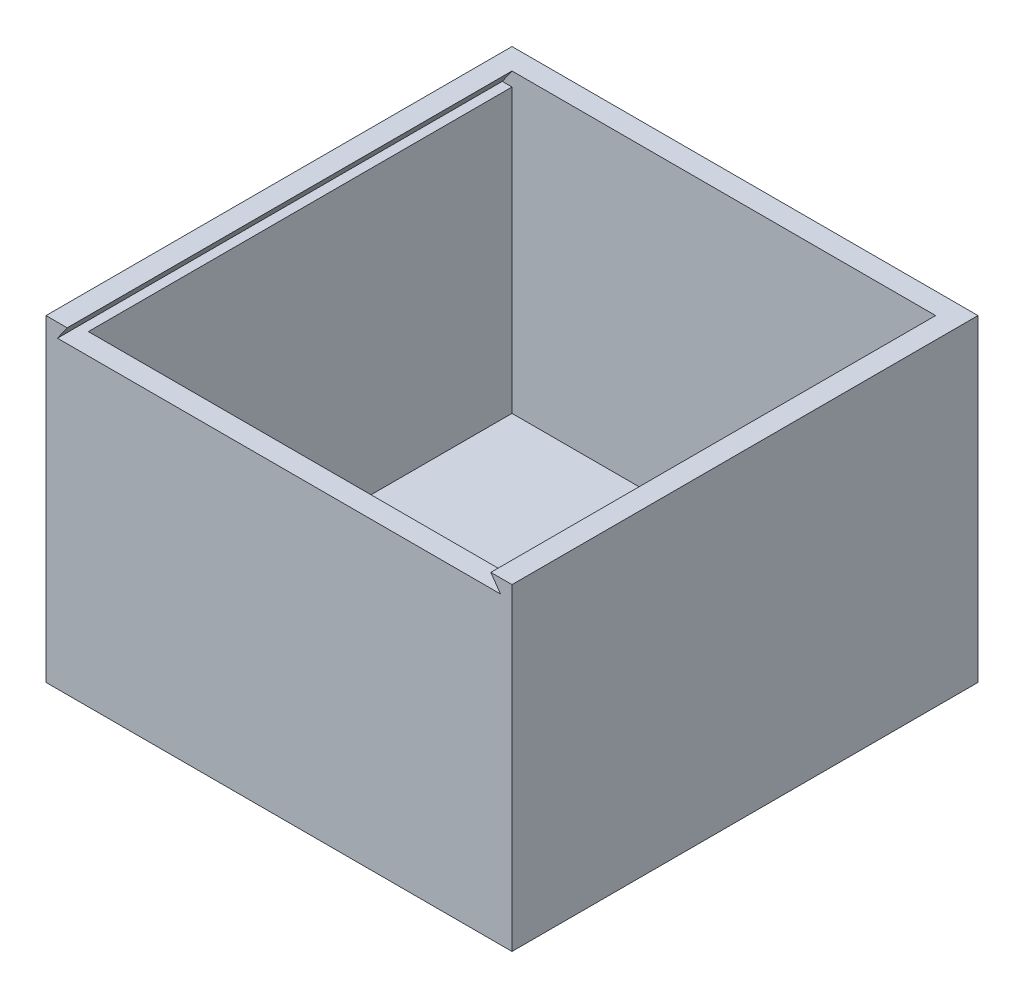
ISO-10303-21;
HEADER;
FILE_DESCRIPTION(('STEP AP214'),'2;1');
FILE_NAME('part.step','',(''),(''),'','','');
FILE_SCHEMA(('AUTOMOTIVE_DESIGN { 1 0 10303 214 1 1 1 1 }'));
ENDSEC;
DATA;
#1=APPLICATION_CONTEXT('core data for automotive mechanical design processes');
#2=APPLICATION_PROTOCOL_DEFINITION('international standard','automotive_design',2000,#1);
#3=PRODUCT_CONTEXT('',#1,'mechanical');
#4=PRODUCT('Part','Part','',(#3));
#5=PRODUCT_RELATED_PRODUCT_CATEGORY('part','',(#4));
#6=PRODUCT_DEFINITION_FORMATION('','',#4);
#7=PRODUCT_DEFINITION_CONTEXT('part definition',#1,'design');
#8=PRODUCT_DEFINITION('design','',#6,#7);
#9=PRODUCT_DEFINITION_SHAPE('','',#8);
#10=(LENGTH_UNIT() NAMED_UNIT(*) SI_UNIT(.MILLI.,.METRE.));
#11=(NAMED_UNIT(*) PLANE_ANGLE_UNIT() SI_UNIT($,.RADIAN.));
#12=(NAMED_UNIT(*) SI_UNIT($,.STERADIAN.) SOLID_ANGLE_UNIT());
#13=UNCERTAINTY_MEASURE_WITH_UNIT(LENGTH_MEASURE(1.E-05),#10,'distance_accuracy_value','');
#14=(GEOMETRIC_REPRESENTATION_CONTEXT(3) GLOBAL_UNCERTAINTY_ASSIGNED_CONTEXT((#13)) GLOBAL_UNIT_ASSIGNED_CONTEXT((#10,
#11,#12)) REPRESENTATION_CONTEXT('',''));
#15=CARTESIAN_POINT('',(0.,0.,0.));
#16=DIRECTION('',(0.,0.,1.));
#17=DIRECTION('',(1.,0.,0.));
#18=AXIS2_PLACEMENT_3D('',#15,#16,#17);
#19=CARTESIAN_POINT('',(-55.,75.,55.));
#20=DIRECTION('',(1.,0.,0.));
#21=DIRECTION('',(0.,0.,-1.));
#22=AXIS2_PLACEMENT_3D('',#19,#20,#21);
#23=PLANE('',#22);
#24=DIRECTION('',(0.,0.,1.));
#25=VECTOR('',#24,1.);
#26=CARTESIAN_POINT('',(-55.,0.,55.));
#27=LINE('',#26,#25);
#28=CARTESIAN_POINT('',(-55.,0.,-55.));
#29=VERTEX_POINT('',#28);
#30=CARTESIAN_POINT('',(-55.,0.,55.));
#31=VERTEX_POINT('',#30);
#32=EDGE_CURVE('E165',#29,#31,#27,.T.);
#33=ORIENTED_EDGE('',*,*,#32,.T.);
#34=DIRECTION('',(0.,-1.,0.));
#35=VECTOR('',#34,1.);
#36=CARTESIAN_POINT('',(-55.,75.,55.));
#37=LINE('',#36,#35);
#38=CARTESIAN_POINT('',(-55.,75.,55.));
#39=VERTEX_POINT('',#38);
#40=EDGE_CURVE('E39',#39,#31,#37,.T.);
#41=ORIENTED_EDGE('',*,*,#40,.F.);
#42=DIRECTION('',(0.,0.,1.));
#43=VECTOR('',#42,1.);
#44=CARTESIAN_POINT('',(-55.,75.,55.));
#45=LINE('',#44,#43);
#46=CARTESIAN_POINT('',(-55.,75.,-55.));
#47=VERTEX_POINT('',#46);
#48=EDGE_CURVE('E174',#47,#39,#45,.T.);
#49=ORIENTED_EDGE('',*,*,#48,.F.);
#50=DIRECTION('',(0.,-1.,0.));
#51=VECTOR('',#50,1.);
#52=CARTESIAN_POINT('',(-55.,75.,-55.));
#53=LINE('',#52,#51);
#54=EDGE_CURVE('E181',#47,#29,#53,.T.);
#55=ORIENTED_EDGE('',*,*,#54,.T.);
#56=EDGE_LOOP('',(#33,#41,#49,#55));
#57=FACE_BOUND('',#56,.T.);
#58=ADVANCED_FACE('F32',(#57),#23,.F.);
#59=CARTESIAN_POINT('',(-55.,75.,55.));
#60=DIRECTION('',(0.,0.,-1.));
#61=DIRECTION('',(-1.,0.,0.));
#62=AXIS2_PLACEMENT_3D('',#59,#60,#61);
#63=PLANE('',#62);
#64=DIRECTION('',(1.,0.,0.));
#65=VECTOR('',#64,1.);
#66=CARTESIAN_POINT('',(-55.,75.,55.));
#67=LINE('',#66,#65);
#68=CARTESIAN_POINT('',(50.,75.,55.));
#69=VERTEX_POINT('',#68);
#70=CARTESIAN_POINT('',(55.,75.,55.));
#71=VERTEX_POINT('',#70);
#72=EDGE_CURVE('E176',#69,#71,#67,.T.);
#73=ORIENTED_EDGE('',*,*,#72,.F.);
#74=DIRECTION('',(-0.573576436351046,0.819152044288992,0.));
#75=VECTOR('',#74,1.);
#76=CARTESIAN_POINT('',(50.,75.,55.));
#77=LINE('',#76,#75);
#78=CARTESIAN_POINT('',(52.2943057454042,71.723391822844,55.));
#79=VERTEX_POINT('',#78);
#80=EDGE_CURVE('E140',#79,#69,#77,.T.);
#81=ORIENTED_EDGE('',*,*,#80,.F.);
#82=DIRECTION('',(1.,0.,0.));
#83=VECTOR('',#82,1.);
#84=CARTESIAN_POINT('',(-52.2943057454042,71.7233918228441,55.));
#85=LINE('',#84,#83);
#86=CARTESIAN_POINT('',(-52.2943057454042,71.7233918228441,55.));
#87=VERTEX_POINT('',#86);
#88=EDGE_CURVE('E333',#87,#79,#85,.T.);
#89=ORIENTED_EDGE('',*,*,#88,.F.);
#90=DIRECTION('',(-0.573576436351055,-0.819152044288986,0.));
#91=VECTOR('',#90,1.);
#92=CARTESIAN_POINT('',(-50.,75.,55.));
#93=LINE('',#92,#91);
#94=CARTESIAN_POINT('',(-50.,75.,55.));
#95=VERTEX_POINT('',#94);
#96=EDGE_CURVE('E331',#95,#87,#93,.T.);
#97=ORIENTED_EDGE('',*,*,#96,.F.);
#98=EDGE_CURVE('E83',#39,#95,#67,.T.);
#99=ORIENTED_EDGE('',*,*,#98,.F.);
#100=ORIENTED_EDGE('',*,*,#40,.T.);
#101=DIRECTION('',(1.,0.,0.));
#102=VECTOR('',#101,1.);
#103=CARTESIAN_POINT('',(-55.,0.,55.));
#104=LINE('',#103,#102);
#105=CARTESIAN_POINT('',(55.,0.,55.));
#106=VERTEX_POINT('',#105);
#107=EDGE_CURVE('E184',#31,#106,#104,.T.);
#108=ORIENTED_EDGE('',*,*,#107,.T.);
#109=DIRECTION('',(0.,-1.,0.));
#110=VECTOR('',#109,1.);
#111=CARTESIAN_POINT('',(55.,75.,55.));
#112=LINE('',#111,#110);
#113=EDGE_CURVE('E192',#71,#106,#112,.T.);
#114=ORIENTED_EDGE('',*,*,#113,.F.);
#115=EDGE_LOOP('',(#73,#81,#89,#97,#99,#100,#108,#114));
#116=FACE_BOUND('',#115,.T.);
#117=ADVANCED_FACE('F196',(#116),#63,.F.);
#118=CARTESIAN_POINT('',(55.,75.,55.));
#119=DIRECTION('',(-1.,0.,0.));
#120=DIRECTION('',(0.,0.,1.));
#121=AXIS2_PLACEMENT_3D('',#118,#119,#120);
#122=PLANE('',#121);
#123=DIRECTION('',(0.,0.,-1.));
#124=VECTOR('',#123,1.);
#125=CARTESIAN_POINT('',(55.,0.,55.));
#126=LINE('',#125,#124);
#127=CARTESIAN_POINT('',(55.,0.,-55.));
#128=VERTEX_POINT('',#127);
#129=EDGE_CURVE('E186',#106,#128,#126,.T.);
#130=ORIENTED_EDGE('',*,*,#129,.T.);
#131=DIRECTION('',(0.,-1.,0.));
#132=VECTOR('',#131,1.);
#133=CARTESIAN_POINT('',(55.,75.,-55.));
#134=LINE('',#133,#132);
#135=CARTESIAN_POINT('',(55.,75.,-55.));
#136=VERTEX_POINT('',#135);
#137=EDGE_CURVE('E190',#136,#128,#134,.T.);
#138=ORIENTED_EDGE('',*,*,#137,.F.);
#139=DIRECTION('',(0.,0.,-1.));
#140=VECTOR('',#139,1.);
#141=CARTESIAN_POINT('',(55.,75.,55.));
#142=LINE('',#141,#140);
#143=EDGE_CURVE('E178',#71,#136,#142,.T.);
#144=ORIENTED_EDGE('',*,*,#143,.F.);
#145=ORIENTED_EDGE('',*,*,#113,.T.);
#146=EDGE_LOOP('',(#130,#138,#144,#145));
#147=FACE_BOUND('',#146,.T.);
#148=ADVANCED_FACE('F206',(#147),#122,.F.);
#149=CARTESIAN_POINT('',(-55.,75.,-55.));
#150=DIRECTION('',(0.,0.,1.));
#151=DIRECTION('',(1.,0.,0.));
#152=AXIS2_PLACEMENT_3D('',#149,#150,#151);
#153=PLANE('',#152);
#154=DIRECTION('',(-1.,0.,0.));
#155=VECTOR('',#154,1.);
#156=CARTESIAN_POINT('',(-55.,0.,-55.));
#157=LINE('',#156,#155);
#158=EDGE_CURVE('E75',#128,#29,#157,.T.);
#159=ORIENTED_EDGE('',*,*,#158,.T.);
#160=ORIENTED_EDGE('',*,*,#54,.F.);
#161=DIRECTION('',(-1.,0.,0.));
#162=VECTOR('',#161,1.);
#163=CARTESIAN_POINT('',(-55.,75.,-55.));
#164=LINE('',#163,#162);
#165=EDGE_CURVE('E54',#136,#47,#164,.T.);
#166=ORIENTED_EDGE('',*,*,#165,.F.);
#167=ORIENTED_EDGE('',*,*,#137,.T.);
#168=EDGE_LOOP('',(#159,#160,#166,#167));
#169=FACE_BOUND('',#168,.T.);
#170=ADVANCED_FACE('F208',(#169),#153,.F.);
#171=CARTESIAN_POINT('',(0.,75.,0.));
#172=DIRECTION('',(0.,-1.,0.));
#173=DIRECTION('',(0.,0.,-1.));
#174=AXIS2_PLACEMENT_3D('',#171,#172,#173);
#175=PLANE('',#174);
#176=DIRECTION('',(0.,0.,-1.));
#177=VECTOR('',#176,1.);
#178=CARTESIAN_POINT('',(50.,75.,50.));
#179=LINE('',#178,#177);
#180=CARTESIAN_POINT('',(50.,75.,-50.));
#181=VERTEX_POINT('',#180);
#182=EDGE_CURVE('E150',#69,#181,#179,.T.);
#183=ORIENTED_EDGE('',*,*,#182,.F.);
#184=ORIENTED_EDGE('',*,*,#72,.T.);
#185=ORIENTED_EDGE('',*,*,#143,.T.);
#186=ORIENTED_EDGE('',*,*,#165,.T.);
#187=ORIENTED_EDGE('',*,*,#48,.T.);
#188=ORIENTED_EDGE('',*,*,#98,.T.);
#189=DIRECTION('',(0.,0.,1.));
#190=VECTOR('',#189,1.);
#191=CARTESIAN_POINT('',(-50.,75.,50.));
#192=LINE('',#191,#190);
#193=CARTESIAN_POINT('',(-50.,75.,-50.));
#194=VERTEX_POINT('',#193);
#195=EDGE_CURVE('E134',#194,#95,#192,.T.);
#196=ORIENTED_EDGE('',*,*,#195,.F.);
#197=DIRECTION('',(-1.,0.,0.));
#198=VECTOR('',#197,1.);
#199=CARTESIAN_POINT('',(-50.,75.,-50.));
#200=LINE('',#199,#198);
#201=EDGE_CURVE('E144',#181,#194,#200,.T.);
#202=ORIENTED_EDGE('',*,*,#201,.F.);
#203=EDGE_LOOP('',(#183,#184,#185,#186,#187,#188,#196,#202));
#204=FACE_BOUND('',#203,.T.);
#205=ADVANCED_FACE('F152',(#204),#175,.F.);
#206=CARTESIAN_POINT('',(0.,0.,0.));
#207=DIRECTION('',(0.,-1.,0.));
#208=DIRECTION('',(0.,0.,-1.));
#209=AXIS2_PLACEMENT_3D('',#206,#207,#208);
#210=PLANE('',#209);
#211=ORIENTED_EDGE('',*,*,#32,.F.);
#212=ORIENTED_EDGE('',*,*,#158,.F.);
#213=ORIENTED_EDGE('',*,*,#129,.F.);
#214=ORIENTED_EDGE('',*,*,#107,.F.);
#215=EDGE_LOOP('',(#211,#212,#213,#214));
#216=FACE_BOUND('',#215,.T.);
#217=ADVANCED_FACE('F202',(#216),#210,.T.);
#218=CARTESIAN_POINT('',(-50.,4.99999999999999,50.));
#219=DIRECTION('',(-1.,0.,0.));
#220=DIRECTION('',(0.,0.,1.));
#221=AXIS2_PLACEMENT_3D('',#218,#219,#220);
#222=PLANE('',#221);
#223=DIRECTION('',(0.,1.,0.));
#224=VECTOR('',#223,1.);
#225=CARTESIAN_POINT('',(-50.,4.99999999999999,-50.));
#226=LINE('',#225,#224);
#227=CARTESIAN_POINT('',(-50.,4.99999999999999,-50.));
#228=VERTEX_POINT('',#227);
#229=CARTESIAN_POINT('',(-50.,71.7233918228441,-50.));
#230=VERTEX_POINT('',#229);
#231=EDGE_CURVE('E162',#228,#230,#226,.T.);
#232=ORIENTED_EDGE('',*,*,#231,.T.);
#233=DIRECTION('',(0.,0.,1.));
#234=VECTOR('',#233,1.);
#235=CARTESIAN_POINT('',(-50.,71.7233918228441,50.));
#236=LINE('',#235,#234);
#237=CARTESIAN_POINT('',(-50.,71.7233918228441,50.));
#238=VERTEX_POINT('',#237);
#239=EDGE_CURVE('E153',#230,#238,#236,.T.);
#240=ORIENTED_EDGE('',*,*,#239,.T.);
#241=DIRECTION('',(0.,1.,0.));
#242=VECTOR('',#241,1.);
#243=CARTESIAN_POINT('',(-50.,4.99999999999999,50.));
#244=LINE('',#243,#242);
#245=CARTESIAN_POINT('',(-50.,4.99999999999999,50.));
#246=VERTEX_POINT('',#245);
#247=EDGE_CURVE('E171',#246,#238,#244,.T.);
#248=ORIENTED_EDGE('',*,*,#247,.F.);
#249=DIRECTION('',(0.,0.,1.));
#250=VECTOR('',#249,1.);
#251=CARTESIAN_POINT('',(-50.,4.99999999999999,50.));
#252=LINE('',#251,#250);
#253=EDGE_CURVE('E149',#228,#246,#252,.T.);
#254=ORIENTED_EDGE('',*,*,#253,.F.);
#255=EDGE_LOOP('',(#232,#240,#248,#254));
#256=FACE_BOUND('',#255,.T.);
#257=ADVANCED_FACE('F245',(#256),#222,.F.);
#258=CARTESIAN_POINT('',(-50.,4.99999999999999,-50.));
#259=DIRECTION('',(0.,0.,-1.));
#260=DIRECTION('',(-1.,0.,0.));
#261=AXIS2_PLACEMENT_3D('',#258,#259,#260);
#262=PLANE('',#261);
#263=DIRECTION('',(0.,1.,0.));
#264=VECTOR('',#263,1.);
#265=CARTESIAN_POINT('',(50.,4.99999999999999,-50.));
#266=LINE('',#265,#264);
#267=CARTESIAN_POINT('',(50.,4.99999999999999,-50.));
#268=VERTEX_POINT('',#267);
#269=CARTESIAN_POINT('',(50.,71.723391822844,-50.));
#270=VERTEX_POINT('',#269);
#271=EDGE_CURVE('E166',#268,#270,#266,.T.);
#272=ORIENTED_EDGE('',*,*,#271,.T.);
#273=DIRECTION('',(1.,0.,0.));
#274=VECTOR('',#273,1.);
#275=CARTESIAN_POINT('',(-52.2943057454042,71.7233918228441,-50.));
#276=LINE('',#275,#274);
#277=CARTESIAN_POINT('',(52.2943057454042,71.723391822844,-50.));
#278=VERTEX_POINT('',#277);
#279=EDGE_CURVE('E139',#270,#278,#276,.T.);
#280=ORIENTED_EDGE('',*,*,#279,.T.);
#281=DIRECTION('',(-0.573576436351046,0.819152044288992,0.));
#282=VECTOR('',#281,1.);
#283=CARTESIAN_POINT('',(50.,75.,-50.));
#284=LINE('',#283,#282);
#285=EDGE_CURVE('E148',#278,#181,#284,.T.);
#286=ORIENTED_EDGE('',*,*,#285,.T.);
#287=ORIENTED_EDGE('',*,*,#201,.T.);
#288=DIRECTION('',(-0.573576436351055,-0.819152044288986,0.));
#289=VECTOR('',#288,1.);
#290=CARTESIAN_POINT('',(-50.,75.,-50.));
#291=LINE('',#290,#289);
#292=CARTESIAN_POINT('',(-52.2943057454042,71.7233918228441,-50.));
#293=VERTEX_POINT('',#292);
#294=EDGE_CURVE('E129',#194,#293,#291,.T.);
#295=ORIENTED_EDGE('',*,*,#294,.T.);
#296=EDGE_CURVE('E327',#293,#230,#276,.T.);
#297=ORIENTED_EDGE('',*,*,#296,.T.);
#298=ORIENTED_EDGE('',*,*,#231,.F.);
#299=DIRECTION('',(-1.,0.,0.));
#300=VECTOR('',#299,1.);
#301=CARTESIAN_POINT('',(-50.,4.99999999999999,-50.));
#302=LINE('',#301,#300);
#303=EDGE_CURVE('E159',#268,#228,#302,.T.);
#304=ORIENTED_EDGE('',*,*,#303,.F.);
#305=EDGE_LOOP('',(#272,#280,#286,#287,#295,#297,#298,#304));
#306=FACE_BOUND('',#305,.T.);
#307=ADVANCED_FACE('F146',(#306),#262,.F.);
#308=CARTESIAN_POINT('',(50.,4.99999999999999,50.));
#309=DIRECTION('',(1.,0.,0.));
#310=DIRECTION('',(0.,0.,-1.));
#311=AXIS2_PLACEMENT_3D('',#308,#309,#310);
#312=PLANE('',#311);
#313=DIRECTION('',(0.,1.,0.));
#314=VECTOR('',#313,1.);
#315=CARTESIAN_POINT('',(50.,4.99999999999999,50.));
#316=LINE('',#315,#314);
#317=CARTESIAN_POINT('',(50.,4.99999999999999,50.));
#318=VERTEX_POINT('',#317);
#319=CARTESIAN_POINT('',(50.,71.723391822844,50.));
#320=VERTEX_POINT('',#319);
#321=EDGE_CURVE('E168',#318,#320,#316,.T.);
#322=ORIENTED_EDGE('',*,*,#321,.T.);
#323=DIRECTION('',(0.,0.,-1.));
#324=VECTOR('',#323,1.);
#325=CARTESIAN_POINT('',(50.,71.723391822844,50.));
#326=LINE('',#325,#324);
#327=EDGE_CURVE('E46',#320,#270,#326,.T.);
#328=ORIENTED_EDGE('',*,*,#327,.T.);
#329=ORIENTED_EDGE('',*,*,#271,.F.);
#330=DIRECTION('',(0.,0.,-1.));
#331=VECTOR('',#330,1.);
#332=CARTESIAN_POINT('',(50.,4.99999999999999,50.));
#333=LINE('',#332,#331);
#334=EDGE_CURVE('E345',#318,#268,#333,.T.);
#335=ORIENTED_EDGE('',*,*,#334,.F.);
#336=EDGE_LOOP('',(#322,#328,#329,#335));
#337=FACE_BOUND('',#336,.T.);
#338=ADVANCED_FACE('F299',(#337),#312,.F.);
#339=CARTESIAN_POINT('',(-50.,4.99999999999999,50.));
#340=DIRECTION('',(0.,0.,1.));
#341=DIRECTION('',(1.,0.,0.));
#342=AXIS2_PLACEMENT_3D('',#339,#340,#341);
#343=PLANE('',#342);
#344=ORIENTED_EDGE('',*,*,#247,.T.);
#345=DIRECTION('',(1.,0.,0.));
#346=VECTOR('',#345,1.);
#347=CARTESIAN_POINT('',(-50.,71.7233918228441,50.));
#348=LINE('',#347,#346);
#349=EDGE_CURVE('E11',#238,#320,#348,.T.);
#350=ORIENTED_EDGE('',*,*,#349,.T.);
#351=ORIENTED_EDGE('',*,*,#321,.F.);
#352=DIRECTION('',(1.,0.,0.));
#353=VECTOR('',#352,1.);
#354=CARTESIAN_POINT('',(-50.,4.99999999999999,50.));
#355=LINE('',#354,#353);
#356=EDGE_CURVE('E343',#246,#318,#355,.T.);
#357=ORIENTED_EDGE('',*,*,#356,.F.);
#358=EDGE_LOOP('',(#344,#350,#351,#357));
#359=FACE_BOUND('',#358,.T.);
#360=ADVANCED_FACE('F256',(#359),#343,.F.);
#361=CARTESIAN_POINT('',(0.,4.99999999999999,0.));
#362=DIRECTION('',(0.,-1.,0.));
#363=DIRECTION('',(0.,0.,-1.));
#364=AXIS2_PLACEMENT_3D('',#361,#362,#363);
#365=PLANE('',#364);
#366=ORIENTED_EDGE('',*,*,#253,.T.);
#367=ORIENTED_EDGE('',*,*,#356,.T.);
#368=ORIENTED_EDGE('',*,*,#334,.T.);
#369=ORIENTED_EDGE('',*,*,#303,.T.);
#370=EDGE_LOOP('',(#366,#367,#368,#369));
#371=FACE_BOUND('',#370,.T.);
#372=ADVANCED_FACE('F251',(#371),#365,.F.);
#373=CARTESIAN_POINT('',(-52.2943057454042,71.7233918228441,-50.));
#374=DIRECTION('',(0.,-1.,0.));
#375=DIRECTION('',(1.,0.,0.));
#376=AXIS2_PLACEMENT_3D('',#373,#374,#375);
#377=PLANE('',#376);
#378=ORIENTED_EDGE('',*,*,#296,.F.);
#379=DIRECTION('',(0.,0.,1.));
#380=VECTOR('',#379,1.);
#381=CARTESIAN_POINT('',(-52.2943057454042,71.7233918228441,-50.));
#382=LINE('',#381,#380);
#383=EDGE_CURVE('E135',#293,#87,#382,.T.);
#384=ORIENTED_EDGE('',*,*,#383,.T.);
#385=ORIENTED_EDGE('',*,*,#88,.T.);
#386=DIRECTION('',(0.,0.,1.));
#387=VECTOR('',#386,1.);
#388=CARTESIAN_POINT('',(52.2943057454042,71.723391822844,-50.));
#389=LINE('',#388,#387);
#390=EDGE_CURVE('E338',#278,#79,#389,.T.);
#391=ORIENTED_EDGE('',*,*,#390,.F.);
#392=ORIENTED_EDGE('',*,*,#279,.F.);
#393=ORIENTED_EDGE('',*,*,#327,.F.);
#394=ORIENTED_EDGE('',*,*,#349,.F.);
#395=ORIENTED_EDGE('',*,*,#239,.F.);
#396=EDGE_LOOP('',(#378,#384,#385,#391,#392,#393,#394,#395));
#397=FACE_BOUND('',#396,.T.);
#398=ADVANCED_FACE('F255',(#397),#377,.F.);
#399=CARTESIAN_POINT('',(50.,75.,-50.));
#400=DIRECTION('',(0.819152044288992,0.573576436351046,0.));
#401=DIRECTION('',(-0.573576436351046,0.819152044288992,0.));
#402=AXIS2_PLACEMENT_3D('',#399,#400,#401);
#403=PLANE('',#402);
#404=ORIENTED_EDGE('',*,*,#80,.T.);
#405=ORIENTED_EDGE('',*,*,#182,.T.);
#406=ORIENTED_EDGE('',*,*,#285,.F.);
#407=ORIENTED_EDGE('',*,*,#390,.T.);
#408=EDGE_LOOP('',(#404,#405,#406,#407));
#409=FACE_BOUND('',#408,.T.);
#410=ADVANCED_FACE('F272',(#409),#403,.F.);
#411=CARTESIAN_POINT('',(-50.,75.,-50.));
#412=DIRECTION('',(-0.819152044288985,0.573576436351055,0.));
#413=DIRECTION('',(-0.573576436351055,-0.819152044288986,0.));
#414=AXIS2_PLACEMENT_3D('',#411,#412,#413);
#415=PLANE('',#414);
#416=ORIENTED_EDGE('',*,*,#96,.T.);
#417=ORIENTED_EDGE('',*,*,#383,.F.);
#418=ORIENTED_EDGE('',*,*,#294,.F.);
#419=ORIENTED_EDGE('',*,*,#195,.T.);
#420=EDGE_LOOP('',(#416,#417,#418,#419));
#421=FACE_BOUND('',#420,.T.);
#422=ADVANCED_FACE('F132',(#421),#415,.F.);
#423=CLOSED_SHELL('',(#58,#117,#148,#170,#205,#217,#257,#307,#338,#360,#372,#398,#410,#422));
#424=MANIFOLD_SOLID_BREP('B2',#423);
#425=ADVANCED_BREP_SHAPE_REPRESENTATION('',(#18,#424),#14);
#426=SHAPE_DEFINITION_REPRESENTATION(#9,#425);
ENDSEC;
END-ISO-10303-21;
